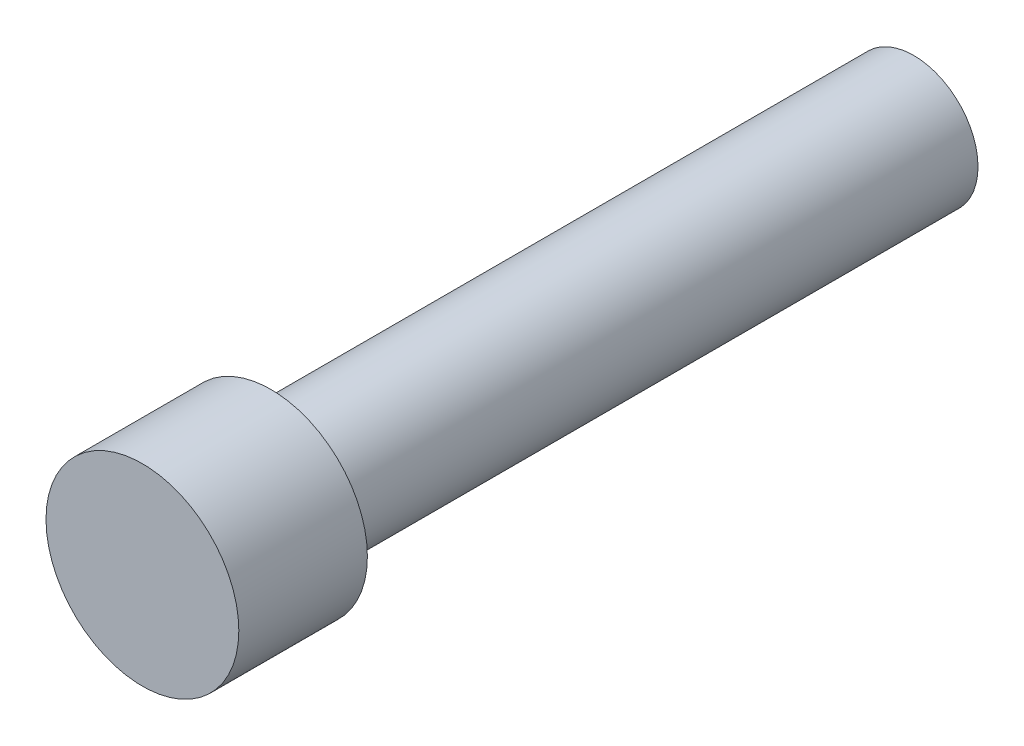
ISO-10303-21;
HEADER;
FILE_DESCRIPTION(('STEP AP214'),'2;1');
FILE_NAME('part.step','',(''),(''),'','','');
FILE_SCHEMA(('AUTOMOTIVE_DESIGN { 1 0 10303 214 1 1 1 1 }'));
ENDSEC;
DATA;
#1=APPLICATION_CONTEXT('core data for automotive mechanical design processes');
#2=APPLICATION_PROTOCOL_DEFINITION('international standard','automotive_design',2000,#1);
#3=PRODUCT_CONTEXT('',#1,'mechanical');
#4=PRODUCT('Part','Part','',(#3));
#5=PRODUCT_RELATED_PRODUCT_CATEGORY('part','',(#4));
#6=PRODUCT_DEFINITION_FORMATION('','',#4);
#7=PRODUCT_DEFINITION_CONTEXT('part definition',#1,'design');
#8=PRODUCT_DEFINITION('design','',#6,#7);
#9=PRODUCT_DEFINITION_SHAPE('','',#8);
#10=(LENGTH_UNIT() NAMED_UNIT(*) SI_UNIT(.MILLI.,.METRE.));
#11=(NAMED_UNIT(*) PLANE_ANGLE_UNIT() SI_UNIT($,.RADIAN.));
#12=(NAMED_UNIT(*) SI_UNIT($,.STERADIAN.) SOLID_ANGLE_UNIT());
#13=UNCERTAINTY_MEASURE_WITH_UNIT(LENGTH_MEASURE(1.E-05),#10,'distance_accuracy_value','');
#14=(GEOMETRIC_REPRESENTATION_CONTEXT(3) GLOBAL_UNCERTAINTY_ASSIGNED_CONTEXT((#13)) GLOBAL_UNIT_ASSIGNED_CONTEXT((#10,
#11,#12)) REPRESENTATION_CONTEXT('',''));
#15=CARTESIAN_POINT('',(0.,0.,0.));
#16=DIRECTION('',(0.,0.,1.));
#17=DIRECTION('',(1.,0.,0.));
#18=AXIS2_PLACEMENT_3D('',#15,#16,#17);
#19=CARTESIAN_POINT('',(0.,0.,31.75));
#20=DIRECTION('',(0.,0.,-1.));
#21=DIRECTION('',(-1.,0.,0.));
#22=AXIS2_PLACEMENT_3D('',#19,#20,#21);
#23=CYLINDRICAL_SURFACE('',#22,3.175);
#24=CARTESIAN_POINT('',(0.,0.,31.75));
#25=DIRECTION('',(0.,0.,1.));
#26=DIRECTION('',(1.,0.,0.));
#27=AXIS2_PLACEMENT_3D('',#24,#25,#26);
#28=CIRCLE('',#27,3.175);
#29=CARTESIAN_POINT('',(3.175,0.,31.75));
#30=VERTEX_POINT('',#29);
#31=EDGE_CURVE('E10',#30,#30,#28,.T.);
#32=ORIENTED_EDGE('',*,*,#31,.F.);
#33=EDGE_LOOP('',(#32));
#34=FACE_BOUND('',#33,.T.);
#35=CARTESIAN_POINT('',(0.,0.,0.));
#36=DIRECTION('',(0.,0.,1.));
#37=DIRECTION('',(1.,0.,0.));
#38=AXIS2_PLACEMENT_3D('',#35,#36,#37);
#39=CIRCLE('',#38,3.175);
#40=CARTESIAN_POINT('',(3.175,0.,0.));
#41=VERTEX_POINT('',#40);
#42=EDGE_CURVE('E35',#41,#41,#39,.T.);
#43=ORIENTED_EDGE('',*,*,#42,.T.);
#44=EDGE_LOOP('',(#43));
#45=FACE_BOUND('',#44,.T.);
#46=ADVANCED_FACE('F32',(#34,#45),#23,.T.);
#47=CARTESIAN_POINT('',(0.,0.,0.));
#48=DIRECTION('',(0.,0.,1.));
#49=DIRECTION('',(1.,0.,0.));
#50=AXIS2_PLACEMENT_3D('',#47,#48,#49);
#51=PLANE('',#50);
#52=ORIENTED_EDGE('',*,*,#42,.F.);
#53=EDGE_LOOP('',(#52));
#54=FACE_BOUND('',#53,.T.);
#55=ADVANCED_FACE('F55',(#54),#51,.F.);
#56=CARTESIAN_POINT('',(0.,0.,38.1));
#57=DIRECTION('',(0.,0.,-1.));
#58=DIRECTION('',(-1.,0.,0.));
#59=AXIS2_PLACEMENT_3D('',#56,#57,#58);
#60=CYLINDRICAL_SURFACE('',#59,4.7625);
#61=CARTESIAN_POINT('',(0.,0.,38.1));
#62=DIRECTION('',(0.,0.,1.));
#63=DIRECTION('',(1.,0.,0.));
#64=AXIS2_PLACEMENT_3D('',#61,#62,#63);
#65=CIRCLE('',#64,4.7625);
#66=CARTESIAN_POINT('',(4.7625,0.,38.1));
#67=VERTEX_POINT('',#66);
#68=EDGE_CURVE('E42',#67,#67,#65,.T.);
#69=ORIENTED_EDGE('',*,*,#68,.F.);
#70=EDGE_LOOP('',(#69));
#71=FACE_BOUND('',#70,.T.);
#72=CARTESIAN_POINT('',(0.,0.,31.75));
#73=DIRECTION('',(0.,0.,1.));
#74=DIRECTION('',(1.,0.,0.));
#75=AXIS2_PLACEMENT_3D('',#72,#73,#74);
#76=CIRCLE('',#75,4.7625);
#77=CARTESIAN_POINT('',(4.7625,0.,31.75));
#78=VERTEX_POINT('',#77);
#79=EDGE_CURVE('E44',#78,#78,#76,.T.);
#80=ORIENTED_EDGE('',*,*,#79,.T.);
#81=EDGE_LOOP('',(#80));
#82=FACE_BOUND('',#81,.T.);
#83=ADVANCED_FACE('F52',(#71,#82),#60,.T.);
#84=CARTESIAN_POINT('',(0.,0.,38.1));
#85=DIRECTION('',(0.,0.,1.));
#86=DIRECTION('',(1.,0.,0.));
#87=AXIS2_PLACEMENT_3D('',#84,#85,#86);
#88=PLANE('',#87);
#89=ORIENTED_EDGE('',*,*,#68,.T.);
#90=EDGE_LOOP('',(#89));
#91=FACE_BOUND('',#90,.T.);
#92=ADVANCED_FACE('F50',(#91),#88,.T.);
#93=CARTESIAN_POINT('',(0.,0.,31.75));
#94=DIRECTION('',(0.,0.,1.));
#95=DIRECTION('',(1.,0.,0.));
#96=AXIS2_PLACEMENT_3D('',#93,#94,#95);
#97=PLANE('',#96);
#98=ORIENTED_EDGE('',*,*,#31,.T.);
#99=EDGE_LOOP('',(#98));
#100=FACE_BOUND('',#99,.T.);
#101=ORIENTED_EDGE('',*,*,#79,.F.);
#102=EDGE_LOOP('',(#101));
#103=FACE_BOUND('',#102,.T.);
#104=ADVANCED_FACE('F59',(#100,#103),#97,.F.);
#105=CLOSED_SHELL('',(#46,#55,#83,#92,#104));
#106=MANIFOLD_SOLID_BREP('B2',#105);
#107=ADVANCED_BREP_SHAPE_REPRESENTATION('',(#18,#106),#14);
#108=SHAPE_DEFINITION_REPRESENTATION(#9,#107);
ENDSEC;
END-ISO-10303-21;
